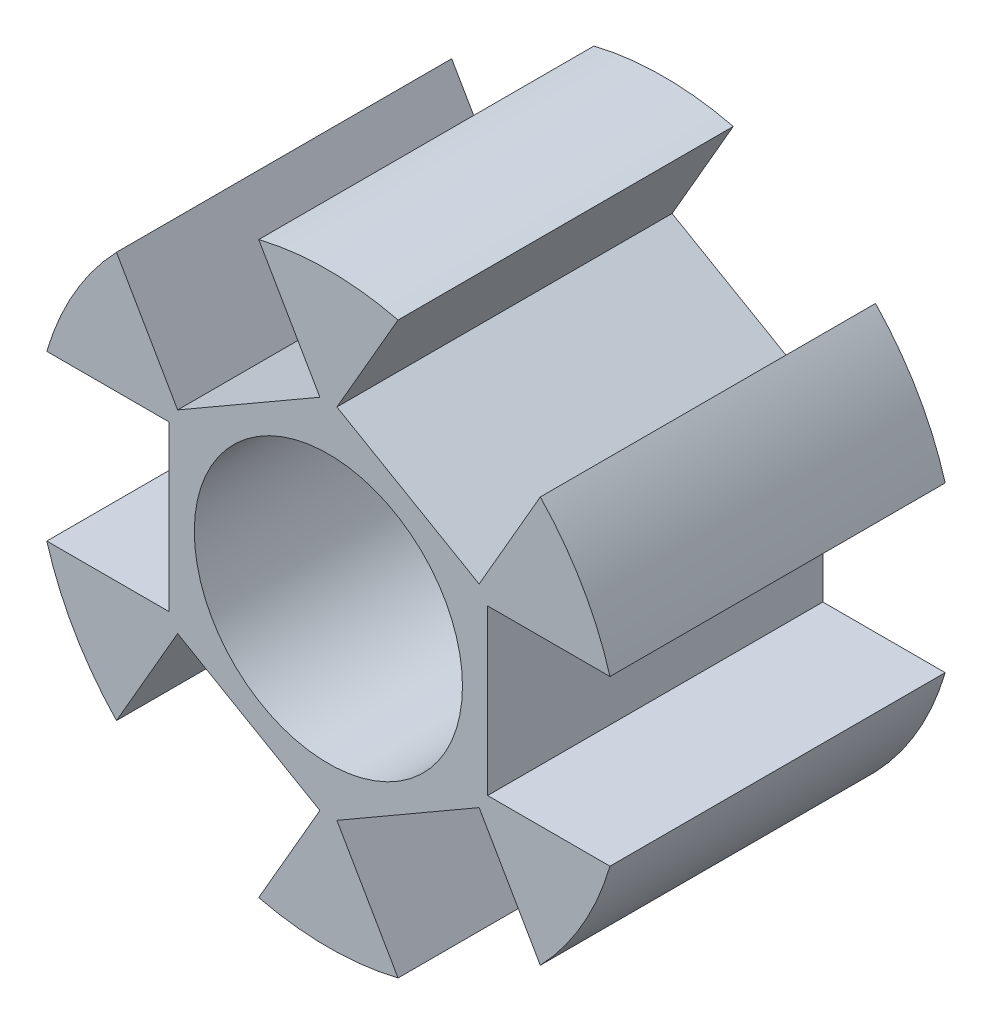
ISO-10303-21;
HEADER;
FILE_DESCRIPTION(('STEP AP214'),'2;1');
FILE_NAME('part.step','',(''),(''),'','','');
FILE_SCHEMA(('AUTOMOTIVE_DESIGN { 1 0 10303 214 1 1 1 1 }'));
ENDSEC;
DATA;
#1=APPLICATION_CONTEXT('core data for automotive mechanical design processes');
#2=APPLICATION_PROTOCOL_DEFINITION('international standard','automotive_design',2000,#1);
#3=PRODUCT_CONTEXT('',#1,'mechanical');
#4=PRODUCT('Part','Part','',(#3));
#5=PRODUCT_RELATED_PRODUCT_CATEGORY('part','',(#4));
#6=PRODUCT_DEFINITION_FORMATION('','',#4);
#7=PRODUCT_DEFINITION_CONTEXT('part definition',#1,'design');
#8=PRODUCT_DEFINITION('design','',#6,#7);
#9=PRODUCT_DEFINITION_SHAPE('','',#8);
#10=(LENGTH_UNIT() NAMED_UNIT(*) SI_UNIT(.MILLI.,.METRE.));
#11=(NAMED_UNIT(*) PLANE_ANGLE_UNIT() SI_UNIT($,.RADIAN.));
#12=(NAMED_UNIT(*) SI_UNIT($,.STERADIAN.) SOLID_ANGLE_UNIT());
#13=UNCERTAINTY_MEASURE_WITH_UNIT(LENGTH_MEASURE(1.E-05),#10,'distance_accuracy_value','');
#14=(GEOMETRIC_REPRESENTATION_CONTEXT(3) GLOBAL_UNCERTAINTY_ASSIGNED_CONTEXT((#13)) GLOBAL_UNIT_ASSIGNED_CONTEXT((#10,
#11,#12)) REPRESENTATION_CONTEXT('',''));
#15=CARTESIAN_POINT('',(0.,0.,0.));
#16=DIRECTION('',(0.,0.,1.));
#17=DIRECTION('',(1.,0.,0.));
#18=AXIS2_PLACEMENT_3D('',#15,#16,#17);
#19=CARTESIAN_POINT('',(0.,0.,5.));
#20=DIRECTION('',(0.,0.,1.));
#21=DIRECTION('',(1.,0.,0.));
#22=AXIS2_PLACEMENT_3D('',#19,#20,#21);
#23=PLANE('',#22);
#24=CARTESIAN_POINT('',(0.,0.,5.));
#25=DIRECTION('',(0.,0.,1.));
#26=DIRECTION('',(1.,0.,0.));
#27=AXIS2_PLACEMENT_3D('',#24,#25,#26);
#28=CIRCLE('',#27,4.);
#29=CARTESIAN_POINT('',(4.,0.,5.));
#30=VERTEX_POINT('',#29);
#31=EDGE_CURVE('E337',#30,#30,#28,.T.);
#32=ORIENTED_EDGE('',*,*,#31,.F.);
#33=EDGE_LOOP('',(#32));
#34=FACE_BOUND('',#33,.T.);
#35=DIRECTION('',(-0.866025403784433,-0.50000000000001,0.));
#36=VECTOR('',#35,1.);
#37=CARTESIAN_POINT('',(-0.253237760728186,5.33862066797608,5.));
#38=LINE('',#37,#36);
#39=CARTESIAN_POINT('',(-0.253237760728186,5.33862066797608,5.));
#40=VERTEX_POINT('',#39);
#41=CARTESIAN_POINT('',(-4.49676223927191,2.88862066797603,5.));
#42=VERTEX_POINT('',#41);
#43=EDGE_CURVE('E281',#40,#42,#38,.T.);
#44=ORIENTED_EDGE('',*,*,#43,.T.);
#45=DIRECTION('',(-0.50000000000001,0.866025403784433,0.));
#46=VECTOR('',#45,1.);
#47=CARTESIAN_POINT('',(-4.49676223927191,2.88862066797603,5.));
#48=LINE('',#47,#46);
#49=CARTESIAN_POINT('',(-6.32176223927195,6.04961339178921,5.));
#50=VERTEX_POINT('',#49);
#51=EDGE_CURVE('E289',#42,#50,#48,.T.);
#52=ORIENTED_EDGE('',*,*,#51,.T.);
#53=CARTESIAN_POINT('',(0.,0.,5.));
#54=DIRECTION('',(0.,0.,1.));
#55=DIRECTION('',(1.,0.,0.));
#56=AXIS2_PLACEMENT_3D('',#53,#54,#55);
#57=CIRCLE('',#56,8.75);
#58=CARTESIAN_POINT('',(-8.4,2.45,5.));
#59=VERTEX_POINT('',#58);
#60=EDGE_CURVE('E349',#50,#59,#57,.T.);
#61=ORIENTED_EDGE('',*,*,#60,.T.);
#62=DIRECTION('',(-1.,0.,0.));
#63=VECTOR('',#62,1.);
#64=CARTESIAN_POINT('',(-4.75,2.45,5.));
#65=LINE('',#64,#63);
#66=CARTESIAN_POINT('',(-4.75,2.45,5.));
#67=VERTEX_POINT('',#66);
#68=EDGE_CURVE('E329',#67,#59,#65,.T.);
#69=ORIENTED_EDGE('',*,*,#68,.F.);
#70=DIRECTION('',(0.,-1.,0.));
#71=VECTOR('',#70,1.);
#72=CARTESIAN_POINT('',(-4.75,2.45,5.));
#73=LINE('',#72,#71);
#74=CARTESIAN_POINT('',(-4.75,-2.45,5.));
#75=VERTEX_POINT('',#74);
#76=EDGE_CURVE('E321',#67,#75,#73,.T.);
#77=ORIENTED_EDGE('',*,*,#76,.T.);
#78=DIRECTION('',(-1.,0.,0.));
#79=VECTOR('',#78,1.);
#80=CARTESIAN_POINT('',(-4.75,-2.45,5.));
#81=LINE('',#80,#79);
#82=CARTESIAN_POINT('',(-8.4,-2.45,5.));
#83=VERTEX_POINT('',#82);
#84=EDGE_CURVE('E323',#75,#83,#81,.T.);
#85=ORIENTED_EDGE('',*,*,#84,.T.);
#86=CARTESIAN_POINT('',(-6.32176223927186,-6.0496133917893,5.));
#87=VERTEX_POINT('',#86);
#88=EDGE_CURVE('E342',#83,#87,#57,.T.);
#89=ORIENTED_EDGE('',*,*,#88,.T.);
#90=DIRECTION('',(-0.499999999999998,-0.86602540378444,0.));
#91=VECTOR('',#90,1.);
#92=CARTESIAN_POINT('',(-4.49676223927187,-2.88862066797609,5.));
#93=LINE('',#92,#91);
#94=CARTESIAN_POINT('',(-4.49676223927187,-2.88862066797609,5.));
#95=VERTEX_POINT('',#94);
#96=EDGE_CURVE('E306',#95,#87,#93,.T.);
#97=ORIENTED_EDGE('',*,*,#96,.F.);
#98=DIRECTION('',(0.86602540378444,-0.499999999999998,0.));
#99=VECTOR('',#98,1.);
#100=CARTESIAN_POINT('',(-4.49676223927187,-2.88862066797609,5.));
#101=LINE('',#100,#99);
#102=CARTESIAN_POINT('',(-0.253237760728112,-5.33862066797608,5.));
#103=VERTEX_POINT('',#102);
#104=EDGE_CURVE('E297',#95,#103,#101,.T.);
#105=ORIENTED_EDGE('',*,*,#104,.T.);
#106=DIRECTION('',(-0.499999999999998,-0.86602540378444,0.));
#107=VECTOR('',#106,1.);
#108=CARTESIAN_POINT('',(-0.253237760728112,-5.33862066797608,5.));
#109=LINE('',#108,#107);
#110=CARTESIAN_POINT('',(-2.07823776072811,-8.49961339178929,5.));
#111=VERTEX_POINT('',#110);
#112=EDGE_CURVE('E303',#103,#111,#109,.T.);
#113=ORIENTED_EDGE('',*,*,#112,.T.);
#114=CARTESIAN_POINT('',(2.07823776072817,-8.49961339178928,5.));
#115=VERTEX_POINT('',#114);
#116=EDGE_CURVE('E348',#111,#115,#57,.T.);
#117=ORIENTED_EDGE('',*,*,#116,.T.);
#118=DIRECTION('',(0.500000000000004,-0.866025403784436,0.));
#119=VECTOR('',#118,1.);
#120=CARTESIAN_POINT('',(0.253237760728149,-5.33862066797608,5.));
#121=LINE('',#120,#119);
#122=CARTESIAN_POINT('',(0.253237760728149,-5.33862066797608,5.));
#123=VERTEX_POINT('',#122);
#124=EDGE_CURVE('E231',#123,#115,#121,.T.);
#125=ORIENTED_EDGE('',*,*,#124,.F.);
#126=DIRECTION('',(0.866025403784436,0.500000000000004,0.));
#127=VECTOR('',#126,1.);
#128=CARTESIAN_POINT('',(0.253237760728149,-5.33862066797608,5.));
#129=LINE('',#128,#127);
#130=CARTESIAN_POINT('',(4.49676223927189,-2.88862066797606,5.));
#131=VERTEX_POINT('',#130);
#132=EDGE_CURVE('E516',#123,#131,#129,.T.);
#133=ORIENTED_EDGE('',*,*,#132,.T.);
#134=DIRECTION('',(0.500000000000004,-0.866025403784436,0.));
#135=VECTOR('',#134,1.);
#136=CARTESIAN_POINT('',(4.49676223927189,-2.88862066797606,5.));
#137=LINE('',#136,#135);
#138=CARTESIAN_POINT('',(6.3217622392719,-6.04961339178926,5.));
#139=VERTEX_POINT('',#138);
#140=EDGE_CURVE('E217',#131,#139,#137,.T.);
#141=ORIENTED_EDGE('',*,*,#140,.T.);
#142=CARTESIAN_POINT('',(8.4,-2.45,5.));
#143=VERTEX_POINT('',#142);
#144=EDGE_CURVE('E430',#139,#143,#57,.T.);
#145=ORIENTED_EDGE('',*,*,#144,.T.);
#146=DIRECTION('',(1.,0.,0.));
#147=VECTOR('',#146,1.);
#148=CARTESIAN_POINT('',(4.75,-2.45,5.));
#149=LINE('',#148,#147);
#150=CARTESIAN_POINT('',(4.75,-2.45,5.));
#151=VERTEX_POINT('',#150);
#152=EDGE_CURVE('E255',#151,#143,#149,.T.);
#153=ORIENTED_EDGE('',*,*,#152,.F.);
#154=DIRECTION('',(0.,1.,0.));
#155=VECTOR('',#154,1.);
#156=CARTESIAN_POINT('',(4.75,-2.45,5.));
#157=LINE('',#156,#155);
#158=CARTESIAN_POINT('',(4.75,2.45,5.));
#159=VERTEX_POINT('',#158);
#160=EDGE_CURVE('E246',#151,#159,#157,.T.);
#161=ORIENTED_EDGE('',*,*,#160,.T.);
#162=DIRECTION('',(1.,0.,0.));
#163=VECTOR('',#162,1.);
#164=CARTESIAN_POINT('',(4.75,2.45,5.));
#165=LINE('',#164,#163);
#166=CARTESIAN_POINT('',(8.4,2.45,5.));
#167=VERTEX_POINT('',#166);
#168=EDGE_CURVE('E248',#159,#167,#165,.T.);
#169=ORIENTED_EDGE('',*,*,#168,.T.);
#170=CARTESIAN_POINT('',(6.32176223927182,6.04961339178935,5.));
#171=VERTEX_POINT('',#170);
#172=EDGE_CURVE('E429',#167,#171,#57,.T.);
#173=ORIENTED_EDGE('',*,*,#172,.T.);
#174=DIRECTION('',(0.499999999999992,0.866025403784443,0.));
#175=VECTOR('',#174,1.);
#176=CARTESIAN_POINT('',(4.49676223927185,2.88862066797612,5.));
#177=LINE('',#176,#175);
#178=CARTESIAN_POINT('',(4.49676223927185,2.88862066797612,5.));
#179=VERTEX_POINT('',#178);
#180=EDGE_CURVE('E63',#179,#171,#177,.T.);
#181=ORIENTED_EDGE('',*,*,#180,.F.);
#182=DIRECTION('',(-0.866025403784443,0.499999999999992,0.));
#183=VECTOR('',#182,1.);
#184=CARTESIAN_POINT('',(4.49676223927185,2.88862066797612,5.));
#185=LINE('',#184,#183);
#186=CARTESIAN_POINT('',(0.253237760728075,5.33862066797609,5.));
#187=VERTEX_POINT('',#186);
#188=EDGE_CURVE('E266',#179,#187,#185,.T.);
#189=ORIENTED_EDGE('',*,*,#188,.T.);
#190=DIRECTION('',(0.499999999999992,0.866025403784443,0.));
#191=VECTOR('',#190,1.);
#192=CARTESIAN_POINT('',(0.253237760728075,5.33862066797609,5.));
#193=LINE('',#192,#191);
#194=CARTESIAN_POINT('',(2.07823776072805,8.49961339178931,5.));
#195=VERTEX_POINT('',#194);
#196=EDGE_CURVE('E268',#187,#195,#193,.T.);
#197=ORIENTED_EDGE('',*,*,#196,.T.);
#198=CARTESIAN_POINT('',(-2.07823776072823,8.49961339178926,5.));
#199=VERTEX_POINT('',#198);
#200=EDGE_CURVE('E433',#195,#199,#57,.T.);
#201=ORIENTED_EDGE('',*,*,#200,.T.);
#202=DIRECTION('',(-0.50000000000001,0.866025403784433,0.));
#203=VECTOR('',#202,1.);
#204=CARTESIAN_POINT('',(-0.253237760728186,5.33862066797608,5.));
#205=LINE('',#204,#203);
#206=EDGE_CURVE('E57',#40,#199,#205,.T.);
#207=ORIENTED_EDGE('',*,*,#206,.F.);
#208=EDGE_LOOP('',(#44,#52,#61,#69,#77,#85,#89,#97,#105,#113,#117,#125,#133,#141,#145,#153,#161,
#169,#173,#181,#189,#197,#201,#207));
#209=FACE_BOUND('',#208,.T.);
#210=ADVANCED_FACE('F41',(#34,#209),#23,.T.);
#211=CARTESIAN_POINT('',(0.,0.,-5.));
#212=DIRECTION('',(0.,0.,1.));
#213=DIRECTION('',(1.,0.,0.));
#214=AXIS2_PLACEMENT_3D('',#211,#212,#213);
#215=PLANE('',#214);
#216=CARTESIAN_POINT('',(0.,0.,-5.));
#217=DIRECTION('',(0.,0.,1.));
#218=DIRECTION('',(1.,0.,0.));
#219=AXIS2_PLACEMENT_3D('',#216,#217,#218);
#220=CIRCLE('',#219,4.);
#221=CARTESIAN_POINT('',(4.,0.,-5.));
#222=VERTEX_POINT('',#221);
#223=EDGE_CURVE('E335',#222,#222,#220,.T.);
#224=ORIENTED_EDGE('',*,*,#223,.T.);
#225=EDGE_LOOP('',(#224));
#226=FACE_BOUND('',#225,.T.);
#227=DIRECTION('',(-0.50000000000001,0.866025403784433,0.));
#228=VECTOR('',#227,1.);
#229=CARTESIAN_POINT('',(-4.49676223927191,2.88862066797603,-5.));
#230=LINE('',#229,#228);
#231=CARTESIAN_POINT('',(-4.49676223927191,2.88862066797603,-5.));
#232=VERTEX_POINT('',#231);
#233=CARTESIAN_POINT('',(-6.32176223927195,6.04961339178921,-5.));
#234=VERTEX_POINT('',#233);
#235=EDGE_CURVE('E263',#232,#234,#230,.T.);
#236=ORIENTED_EDGE('',*,*,#235,.F.);
#237=DIRECTION('',(0.866025403784433,0.50000000000001,0.));
#238=VECTOR('',#237,1.);
#239=CARTESIAN_POINT('',(-0.253237760728186,5.33862066797608,-5.));
#240=LINE('',#239,#238);
#241=CARTESIAN_POINT('',(-0.253237760728186,5.33862066797608,-5.));
#242=VERTEX_POINT('',#241);
#243=EDGE_CURVE('E280',#232,#242,#240,.T.);
#244=ORIENTED_EDGE('',*,*,#243,.T.);
#245=DIRECTION('',(-0.50000000000001,0.866025403784433,0.));
#246=VECTOR('',#245,1.);
#247=CARTESIAN_POINT('',(-0.253237760728186,5.33862066797608,-5.));
#248=LINE('',#247,#246);
#249=CARTESIAN_POINT('',(-2.07823776072823,8.49961339178926,-5.));
#250=VERTEX_POINT('',#249);
#251=EDGE_CURVE('E292',#242,#250,#248,.T.);
#252=ORIENTED_EDGE('',*,*,#251,.T.);
#253=CARTESIAN_POINT('',(0.,0.,-5.));
#254=DIRECTION('',(0.,0.,1.));
#255=DIRECTION('',(1.,0.,0.));
#256=AXIS2_PLACEMENT_3D('',#253,#254,#255);
#257=CIRCLE('',#256,8.75);
#258=CARTESIAN_POINT('',(2.07823776072805,8.49961339178931,-5.));
#259=VERTEX_POINT('',#258);
#260=EDGE_CURVE('E378',#259,#250,#257,.T.);
#261=ORIENTED_EDGE('',*,*,#260,.F.);
#262=DIRECTION('',(0.499999999999992,0.866025403784443,0.));
#263=VECTOR('',#262,1.);
#264=CARTESIAN_POINT('',(0.253237760728075,5.33862066797609,-5.));
#265=LINE('',#264,#263);
#266=CARTESIAN_POINT('',(0.253237760728075,5.33862066797609,-5.));
#267=VERTEX_POINT('',#266);
#268=EDGE_CURVE('E241',#267,#259,#265,.T.);
#269=ORIENTED_EDGE('',*,*,#268,.F.);
#270=DIRECTION('',(0.866025403784443,-0.499999999999992,0.));
#271=VECTOR('',#270,1.);
#272=CARTESIAN_POINT('',(4.49676223927185,2.88862066797612,-5.));
#273=LINE('',#272,#271);
#274=CARTESIAN_POINT('',(4.49676223927185,2.88862066797612,-5.));
#275=VERTEX_POINT('',#274);
#276=EDGE_CURVE('E260',#267,#275,#273,.T.);
#277=ORIENTED_EDGE('',*,*,#276,.T.);
#278=DIRECTION('',(0.499999999999992,0.866025403784443,0.));
#279=VECTOR('',#278,1.);
#280=CARTESIAN_POINT('',(4.49676223927185,2.88862066797612,-5.));
#281=LINE('',#280,#279);
#282=CARTESIAN_POINT('',(6.32176223927182,6.04961339178935,-5.));
#283=VERTEX_POINT('',#282);
#284=EDGE_CURVE('E271',#275,#283,#281,.T.);
#285=ORIENTED_EDGE('',*,*,#284,.T.);
#286=CARTESIAN_POINT('',(8.4,2.45,-5.));
#287=VERTEX_POINT('',#286);
#288=EDGE_CURVE('E385',#287,#283,#257,.T.);
#289=ORIENTED_EDGE('',*,*,#288,.F.);
#290=DIRECTION('',(1.,0.,0.));
#291=VECTOR('',#290,1.);
#292=CARTESIAN_POINT('',(4.75,2.45,-5.));
#293=LINE('',#292,#291);
#294=CARTESIAN_POINT('',(4.75,2.45,-5.));
#295=VERTEX_POINT('',#294);
#296=EDGE_CURVE('E220',#295,#287,#293,.T.);
#297=ORIENTED_EDGE('',*,*,#296,.F.);
#298=DIRECTION('',(0.,-1.,0.));
#299=VECTOR('',#298,1.);
#300=CARTESIAN_POINT('',(4.75,-2.45,-5.));
#301=LINE('',#300,#299);
#302=CARTESIAN_POINT('',(4.75,-2.45,-5.));
#303=VERTEX_POINT('',#302);
#304=EDGE_CURVE('E239',#295,#303,#301,.T.);
#305=ORIENTED_EDGE('',*,*,#304,.T.);
#306=DIRECTION('',(1.,0.,0.));
#307=VECTOR('',#306,1.);
#308=CARTESIAN_POINT('',(4.75,-2.45,-5.));
#309=LINE('',#308,#307);
#310=CARTESIAN_POINT('',(8.4,-2.45,-5.));
#311=VERTEX_POINT('',#310);
#312=EDGE_CURVE('E251',#303,#311,#309,.T.);
#313=ORIENTED_EDGE('',*,*,#312,.T.);
#314=CARTESIAN_POINT('',(6.3217622392719,-6.04961339178926,-5.));
#315=VERTEX_POINT('',#314);
#316=EDGE_CURVE('E228',#315,#311,#257,.T.);
#317=ORIENTED_EDGE('',*,*,#316,.F.);
#318=DIRECTION('',(0.500000000000004,-0.866025403784436,0.));
#319=VECTOR('',#318,1.);
#320=CARTESIAN_POINT('',(4.49676223927189,-2.88862066797606,-5.));
#321=LINE('',#320,#319);
#322=CARTESIAN_POINT('',(4.49676223927189,-2.88862066797606,-5.));
#323=VERTEX_POINT('',#322);
#324=EDGE_CURVE('E215',#323,#315,#321,.T.);
#325=ORIENTED_EDGE('',*,*,#324,.F.);
#326=DIRECTION('',(-0.866025403784436,-0.500000000000004,0.));
#327=VECTOR('',#326,1.);
#328=CARTESIAN_POINT('',(0.253237760728149,-5.33862066797608,-5.));
#329=LINE('',#328,#327);
#330=CARTESIAN_POINT('',(0.253237760728149,-5.33862066797608,-5.));
#331=VERTEX_POINT('',#330);
#332=EDGE_CURVE('E202',#323,#331,#329,.T.);
#333=ORIENTED_EDGE('',*,*,#332,.T.);
#334=DIRECTION('',(0.500000000000004,-0.866025403784436,0.));
#335=VECTOR('',#334,1.);
#336=CARTESIAN_POINT('',(0.253237760728149,-5.33862066797608,-5.));
#337=LINE('',#336,#335);
#338=CARTESIAN_POINT('',(2.07823776072816,-8.49961339178928,-5.));
#339=VERTEX_POINT('',#338);
#340=EDGE_CURVE('E226',#331,#339,#337,.T.);
#341=ORIENTED_EDGE('',*,*,#340,.T.);
#342=CARTESIAN_POINT('',(-2.07823776072811,-8.49961339178929,-5.));
#343=VERTEX_POINT('',#342);
#344=EDGE_CURVE('E351',#343,#339,#257,.T.);
#345=ORIENTED_EDGE('',*,*,#344,.F.);
#346=DIRECTION('',(-0.499999999999998,-0.86602540378444,0.));
#347=VECTOR('',#346,1.);
#348=CARTESIAN_POINT('',(-0.253237760728112,-5.33862066797608,-5.));
#349=LINE('',#348,#347);
#350=CARTESIAN_POINT('',(-0.253237760728112,-5.33862066797608,-5.));
#351=VERTEX_POINT('',#350);
#352=EDGE_CURVE('E311',#351,#343,#349,.T.);
#353=ORIENTED_EDGE('',*,*,#352,.F.);
#354=DIRECTION('',(-0.86602540378444,0.499999999999998,0.));
#355=VECTOR('',#354,1.);
#356=CARTESIAN_POINT('',(-4.49676223927187,-2.88862066797609,-5.));
#357=LINE('',#356,#355);
#358=CARTESIAN_POINT('',(-4.49676223927187,-2.88862066797609,-5.));
#359=VERTEX_POINT('',#358);
#360=EDGE_CURVE('E233',#351,#359,#357,.T.);
#361=ORIENTED_EDGE('',*,*,#360,.T.);
#362=DIRECTION('',(-0.499999999999998,-0.86602540378444,0.));
#363=VECTOR('',#362,1.);
#364=CARTESIAN_POINT('',(-4.49676223927187,-2.88862066797609,-5.));
#365=LINE('',#364,#363);
#366=CARTESIAN_POINT('',(-6.32176223927186,-6.0496133917893,-5.));
#367=VERTEX_POINT('',#366);
#368=EDGE_CURVE('E308',#359,#367,#365,.T.);
#369=ORIENTED_EDGE('',*,*,#368,.T.);
#370=CARTESIAN_POINT('',(-8.4,-2.45,-5.));
#371=VERTEX_POINT('',#370);
#372=EDGE_CURVE('E347',#371,#367,#257,.T.);
#373=ORIENTED_EDGE('',*,*,#372,.F.);
#374=DIRECTION('',(-1.,0.,0.));
#375=VECTOR('',#374,1.);
#376=CARTESIAN_POINT('',(-4.75,-2.45,-5.));
#377=LINE('',#376,#375);
#378=CARTESIAN_POINT('',(-4.75,-2.45,-5.));
#379=VERTEX_POINT('',#378);
#380=EDGE_CURVE('E334',#379,#371,#377,.T.);
#381=ORIENTED_EDGE('',*,*,#380,.F.);
#382=DIRECTION('',(0.,1.,0.));
#383=VECTOR('',#382,1.);
#384=CARTESIAN_POINT('',(-4.75,2.45,-5.));
#385=LINE('',#384,#383);
#386=CARTESIAN_POINT('',(-4.75,2.45,-5.));
#387=VERTEX_POINT('',#386);
#388=EDGE_CURVE('E317',#379,#387,#385,.T.);
#389=ORIENTED_EDGE('',*,*,#388,.T.);
#390=DIRECTION('',(-1.,0.,0.));
#391=VECTOR('',#390,1.);
#392=CARTESIAN_POINT('',(-4.75,2.45,-5.));
#393=LINE('',#392,#391);
#394=CARTESIAN_POINT('',(-8.4,2.45,-5.));
#395=VERTEX_POINT('',#394);
#396=EDGE_CURVE('E326',#387,#395,#393,.T.);
#397=ORIENTED_EDGE('',*,*,#396,.T.);
#398=EDGE_CURVE('E339',#234,#395,#257,.T.);
#399=ORIENTED_EDGE('',*,*,#398,.F.);
#400=EDGE_LOOP('',(#236,#244,#252,#261,#269,#277,#285,#289,#297,#305,#313,#317,#325,#333,#341,
#345,#353,#361,#369,#373,#381,#389,#397,#399));
#401=FACE_BOUND('',#400,.T.);
#402=ADVANCED_FACE('F224',(#226,#401),#215,.F.);
#403=CARTESIAN_POINT('',(0.,0.,5.));
#404=DIRECTION('',(0.,0.,-1.));
#405=DIRECTION('',(-1.,0.,0.));
#406=AXIS2_PLACEMENT_3D('',#403,#404,#405);
#407=CYLINDRICAL_SURFACE('',#406,8.75);
#408=DIRECTION('',(0.,0.,-1.));
#409=VECTOR('',#408,1.);
#410=CARTESIAN_POINT('',(-6.32176223927195,6.04961339178921,5.));
#411=LINE('',#410,#409);
#412=EDGE_CURVE('E11',#234,#50,#411,.F.);
#413=ORIENTED_EDGE('',*,*,#412,.F.);
#414=ORIENTED_EDGE('',*,*,#398,.T.);
#415=DIRECTION('',(0.,0.,-1.));
#416=VECTOR('',#415,1.);
#417=CARTESIAN_POINT('',(-8.4,2.45,5.));
#418=LINE('',#417,#416);
#419=EDGE_CURVE('E345',#59,#395,#418,.T.);
#420=ORIENTED_EDGE('',*,*,#419,.F.);
#421=ORIENTED_EDGE('',*,*,#60,.F.);
#422=EDGE_LOOP('',(#413,#414,#420,#421));
#423=FACE_BOUND('',#422,.T.);
#424=ADVANCED_FACE('F43',(#423),#407,.T.);
#425=DIRECTION('',(0.,0.,-1.));
#426=VECTOR('',#425,1.);
#427=CARTESIAN_POINT('',(-2.07823776072823,8.49961339178926,5.));
#428=LINE('',#427,#426);
#429=EDGE_CURVE('E47',#199,#250,#428,.T.);
#430=ORIENTED_EDGE('',*,*,#429,.F.);
#431=ORIENTED_EDGE('',*,*,#200,.F.);
#432=DIRECTION('',(0.,0.,-1.));
#433=VECTOR('',#432,1.);
#434=CARTESIAN_POINT('',(2.07823776072805,8.49961339178931,5.));
#435=LINE('',#434,#433);
#436=EDGE_CURVE('E369',#259,#195,#435,.F.);
#437=ORIENTED_EDGE('',*,*,#436,.F.);
#438=ORIENTED_EDGE('',*,*,#260,.T.);
#439=EDGE_LOOP('',(#430,#431,#437,#438));
#440=FACE_BOUND('',#439,.T.);
#441=ADVANCED_FACE('F382',(#440),#407,.T.);
#442=DIRECTION('',(0.,0.,-1.));
#443=VECTOR('',#442,1.);
#444=CARTESIAN_POINT('',(6.32176223927182,6.04961339178935,5.));
#445=LINE('',#444,#443);
#446=EDGE_CURVE('E368',#171,#283,#445,.T.);
#447=ORIENTED_EDGE('',*,*,#446,.F.);
#448=ORIENTED_EDGE('',*,*,#172,.F.);
#449=DIRECTION('',(0.,0.,-1.));
#450=VECTOR('',#449,1.);
#451=CARTESIAN_POINT('',(8.4,2.45,5.));
#452=LINE('',#451,#450);
#453=EDGE_CURVE('E366',#287,#167,#452,.F.);
#454=ORIENTED_EDGE('',*,*,#453,.F.);
#455=ORIENTED_EDGE('',*,*,#288,.T.);
#456=EDGE_LOOP('',(#447,#448,#454,#455));
#457=FACE_BOUND('',#456,.T.);
#458=ADVANCED_FACE('F504',(#457),#407,.T.);
#459=DIRECTION('',(0.,0.,-1.));
#460=VECTOR('',#459,1.);
#461=CARTESIAN_POINT('',(8.4,-2.45,5.));
#462=LINE('',#461,#460);
#463=EDGE_CURVE('E364',#143,#311,#462,.T.);
#464=ORIENTED_EDGE('',*,*,#463,.F.);
#465=ORIENTED_EDGE('',*,*,#144,.F.);
#466=DIRECTION('',(0.,0.,-1.));
#467=VECTOR('',#466,1.);
#468=CARTESIAN_POINT('',(6.3217622392719,-6.04961339178926,5.));
#469=LINE('',#468,#467);
#470=EDGE_CURVE('E365',#315,#139,#469,.F.);
#471=ORIENTED_EDGE('',*,*,#470,.F.);
#472=ORIENTED_EDGE('',*,*,#316,.T.);
#473=EDGE_LOOP('',(#464,#465,#471,#472));
#474=FACE_BOUND('',#473,.T.);
#475=ADVANCED_FACE('F514',(#474),#407,.T.);
#476=DIRECTION('',(0.,0.,-1.));
#477=VECTOR('',#476,1.);
#478=CARTESIAN_POINT('',(2.07823776072816,-8.49961339178928,5.));
#479=LINE('',#478,#477);
#480=EDGE_CURVE('E359',#115,#339,#479,.T.);
#481=ORIENTED_EDGE('',*,*,#480,.F.);
#482=ORIENTED_EDGE('',*,*,#116,.F.);
#483=DIRECTION('',(0.,0.,-1.));
#484=VECTOR('',#483,1.);
#485=CARTESIAN_POINT('',(-2.07823776072811,-8.49961339178929,5.));
#486=LINE('',#485,#484);
#487=EDGE_CURVE('E356',#343,#111,#486,.F.);
#488=ORIENTED_EDGE('',*,*,#487,.F.);
#489=ORIENTED_EDGE('',*,*,#344,.T.);
#490=EDGE_LOOP('',(#481,#482,#488,#489));
#491=FACE_BOUND('',#490,.T.);
#492=ADVANCED_FACE('F424',(#491),#407,.T.);
#493=DIRECTION('',(0.,0.,-1.));
#494=VECTOR('',#493,1.);
#495=CARTESIAN_POINT('',(-6.32176223927186,-6.0496133917893,5.));
#496=LINE('',#495,#494);
#497=EDGE_CURVE('E358',#87,#367,#496,.T.);
#498=ORIENTED_EDGE('',*,*,#497,.F.);
#499=ORIENTED_EDGE('',*,*,#88,.F.);
#500=DIRECTION('',(0.,0.,-1.));
#501=VECTOR('',#500,1.);
#502=CARTESIAN_POINT('',(-8.4,-2.45,5.));
#503=LINE('',#502,#501);
#504=EDGE_CURVE('E353',#371,#83,#503,.F.);
#505=ORIENTED_EDGE('',*,*,#504,.F.);
#506=ORIENTED_EDGE('',*,*,#372,.T.);
#507=EDGE_LOOP('',(#498,#499,#505,#506));
#508=FACE_BOUND('',#507,.T.);
#509=ADVANCED_FACE('F407',(#508),#407,.T.);
#510=CARTESIAN_POINT('',(0.,0.,5.));
#511=DIRECTION('',(0.,0.,-1.));
#512=DIRECTION('',(-1.,0.,0.));
#513=AXIS2_PLACEMENT_3D('',#510,#511,#512);
#514=CYLINDRICAL_SURFACE('',#513,4.);
#515=ORIENTED_EDGE('',*,*,#31,.T.);
#516=EDGE_LOOP('',(#515));
#517=FACE_BOUND('',#516,.T.);
#518=ORIENTED_EDGE('',*,*,#223,.F.);
#519=EDGE_LOOP('',(#518));
#520=FACE_BOUND('',#519,.T.);
#521=ADVANCED_FACE('F457',(#517,#520),#514,.F.);
#522=CARTESIAN_POINT('',(-4.75,-2.45,5.));
#523=DIRECTION('',(0.,1.,0.));
#524=DIRECTION('',(0.,0.,1.));
#525=AXIS2_PLACEMENT_3D('',#522,#523,#524);
#526=PLANE('',#525);
#527=ORIENTED_EDGE('',*,*,#504,.T.);
#528=ORIENTED_EDGE('',*,*,#84,.F.);
#529=DIRECTION('',(0.,0.,-1.));
#530=VECTOR('',#529,1.);
#531=CARTESIAN_POINT('',(-4.75,-2.45,5.));
#532=LINE('',#531,#530);
#533=EDGE_CURVE('E312',#75,#379,#532,.T.);
#534=ORIENTED_EDGE('',*,*,#533,.T.);
#535=ORIENTED_EDGE('',*,*,#380,.T.);
#536=EDGE_LOOP('',(#527,#528,#534,#535));
#537=FACE_BOUND('',#536,.T.);
#538=ADVANCED_FACE('F400',(#537),#526,.T.);
#539=CARTESIAN_POINT('',(-4.75,2.45,5.));
#540=DIRECTION('',(0.,-1.,0.));
#541=DIRECTION('',(0.,0.,-1.));
#542=AXIS2_PLACEMENT_3D('',#539,#540,#541);
#543=PLANE('',#542);
#544=ORIENTED_EDGE('',*,*,#419,.T.);
#545=ORIENTED_EDGE('',*,*,#396,.F.);
#546=DIRECTION('',(0.,0.,1.));
#547=VECTOR('',#546,1.);
#548=CARTESIAN_POINT('',(-4.75,2.45,5.));
#549=LINE('',#548,#547);
#550=EDGE_CURVE('E316',#387,#67,#549,.T.);
#551=ORIENTED_EDGE('',*,*,#550,.T.);
#552=ORIENTED_EDGE('',*,*,#68,.T.);
#553=EDGE_LOOP('',(#544,#545,#551,#552));
#554=FACE_BOUND('',#553,.T.);
#555=ADVANCED_FACE('F390',(#554),#543,.T.);
#556=CARTESIAN_POINT('',(-4.75,0.,0.));
#557=DIRECTION('',(-1.,0.,0.));
#558=DIRECTION('',(0.,0.,1.));
#559=AXIS2_PLACEMENT_3D('',#556,#557,#558);
#560=PLANE('',#559);
#561=ORIENTED_EDGE('',*,*,#533,.F.);
#562=ORIENTED_EDGE('',*,*,#76,.F.);
#563=ORIENTED_EDGE('',*,*,#550,.F.);
#564=ORIENTED_EDGE('',*,*,#388,.F.);
#565=EDGE_LOOP('',(#561,#562,#563,#564));
#566=FACE_BOUND('',#565,.T.);
#567=ADVANCED_FACE('F397',(#566),#560,.T.);
#568=CARTESIAN_POINT('',(-0.253237760728112,-5.33862066797608,5.));
#569=DIRECTION('',(-0.86602540378444,0.499999999999998,0.));
#570=DIRECTION('',(-0.499999999999998,-0.86602540378444,0.));
#571=AXIS2_PLACEMENT_3D('',#568,#569,#570);
#572=PLANE('',#571);
#573=ORIENTED_EDGE('',*,*,#487,.T.);
#574=ORIENTED_EDGE('',*,*,#112,.F.);
#575=DIRECTION('',(0.,0.,-1.));
#576=VECTOR('',#575,1.);
#577=CARTESIAN_POINT('',(-0.253237760728112,-5.33862066797608,5.));
#578=LINE('',#577,#576);
#579=EDGE_CURVE('E227',#103,#351,#578,.T.);
#580=ORIENTED_EDGE('',*,*,#579,.T.);
#581=ORIENTED_EDGE('',*,*,#352,.T.);
#582=EDGE_LOOP('',(#573,#574,#580,#581));
#583=FACE_BOUND('',#582,.T.);
#584=ADVANCED_FACE('F419',(#583),#572,.T.);
#585=CARTESIAN_POINT('',(-4.49676223927187,-2.88862066797609,5.));
#586=DIRECTION('',(0.86602540378444,-0.499999999999998,0.));
#587=DIRECTION('',(0.499999999999998,0.86602540378444,0.));
#588=AXIS2_PLACEMENT_3D('',#585,#586,#587);
#589=PLANE('',#588);
#590=ORIENTED_EDGE('',*,*,#497,.T.);
#591=ORIENTED_EDGE('',*,*,#368,.F.);
#592=DIRECTION('',(0.,0.,1.));
#593=VECTOR('',#592,1.);
#594=CARTESIAN_POINT('',(-4.49676223927187,-2.88862066797609,5.));
#595=LINE('',#594,#593);
#596=EDGE_CURVE('E296',#359,#95,#595,.T.);
#597=ORIENTED_EDGE('',*,*,#596,.T.);
#598=ORIENTED_EDGE('',*,*,#96,.T.);
#599=EDGE_LOOP('',(#590,#591,#597,#598));
#600=FACE_BOUND('',#599,.T.);
#601=ADVANCED_FACE('F408',(#600),#589,.T.);
#602=CARTESIAN_POINT('',(-2.37499999999999,-4.11362066797609,0.));
#603=DIRECTION('',(-0.499999999999998,-0.86602540378444,0.));
#604=DIRECTION('',(0.,0.,1.));
#605=AXIS2_PLACEMENT_3D('',#602,#603,#604);
#606=PLANE('',#605);
#607=ORIENTED_EDGE('',*,*,#579,.F.);
#608=ORIENTED_EDGE('',*,*,#104,.F.);
#609=ORIENTED_EDGE('',*,*,#596,.F.);
#610=ORIENTED_EDGE('',*,*,#360,.F.);
#611=EDGE_LOOP('',(#607,#608,#609,#610));
#612=FACE_BOUND('',#611,.T.);
#613=ADVANCED_FACE('F411',(#612),#606,.T.);
#614=CARTESIAN_POINT('',(4.49676223927189,-2.88862066797606,5.));
#615=DIRECTION('',(-0.866025403784436,-0.500000000000004,0.));
#616=DIRECTION('',(0.500000000000004,-0.866025403784436,0.));
#617=AXIS2_PLACEMENT_3D('',#614,#615,#616);
#618=PLANE('',#617);
#619=ORIENTED_EDGE('',*,*,#470,.T.);
#620=ORIENTED_EDGE('',*,*,#140,.F.);
#621=DIRECTION('',(0.,0.,-1.));
#622=VECTOR('',#621,1.);
#623=CARTESIAN_POINT('',(4.49676223927189,-2.88862066797606,5.));
#624=LINE('',#623,#622);
#625=EDGE_CURVE('E207',#131,#323,#624,.T.);
#626=ORIENTED_EDGE('',*,*,#625,.T.);
#627=ORIENTED_EDGE('',*,*,#324,.T.);
#628=EDGE_LOOP('',(#619,#620,#626,#627));
#629=FACE_BOUND('',#628,.T.);
#630=ADVANCED_FACE('F213',(#629),#618,.T.);
#631=CARTESIAN_POINT('',(0.253237760728149,-5.33862066797608,5.));
#632=DIRECTION('',(0.866025403784436,0.500000000000004,0.));
#633=DIRECTION('',(-0.500000000000004,0.866025403784436,0.));
#634=AXIS2_PLACEMENT_3D('',#631,#632,#633);
#635=PLANE('',#634);
#636=ORIENTED_EDGE('',*,*,#480,.T.);
#637=ORIENTED_EDGE('',*,*,#340,.F.);
#638=DIRECTION('',(0.,0.,1.));
#639=VECTOR('',#638,1.);
#640=CARTESIAN_POINT('',(0.253237760728149,-5.33862066797608,5.));
#641=LINE('',#640,#639);
#642=EDGE_CURVE('E206',#331,#123,#641,.T.);
#643=ORIENTED_EDGE('',*,*,#642,.T.);
#644=ORIENTED_EDGE('',*,*,#124,.T.);
#645=EDGE_LOOP('',(#636,#637,#643,#644));
#646=FACE_BOUND('',#645,.T.);
#647=ADVANCED_FACE('F513',(#646),#635,.T.);
#648=CARTESIAN_POINT('',(2.37500000000002,-4.11362066797607,0.));
#649=DIRECTION('',(0.500000000000004,-0.866025403784436,0.));
#650=DIRECTION('',(0.,0.,1.));
#651=AXIS2_PLACEMENT_3D('',#648,#649,#650);
#652=PLANE('',#651);
#653=ORIENTED_EDGE('',*,*,#625,.F.);
#654=ORIENTED_EDGE('',*,*,#132,.F.);
#655=ORIENTED_EDGE('',*,*,#642,.F.);
#656=ORIENTED_EDGE('',*,*,#332,.F.);
#657=EDGE_LOOP('',(#653,#654,#655,#656));
#658=FACE_BOUND('',#657,.T.);
#659=ADVANCED_FACE('F203',(#658),#652,.T.);
#660=CARTESIAN_POINT('',(4.75,2.45,5.));
#661=DIRECTION('',(0.,-1.,0.));
#662=DIRECTION('',(0.,0.,-1.));
#663=AXIS2_PLACEMENT_3D('',#660,#661,#662);
#664=PLANE('',#663);
#665=ORIENTED_EDGE('',*,*,#453,.T.);
#666=ORIENTED_EDGE('',*,*,#168,.F.);
#667=DIRECTION('',(0.,0.,-1.));
#668=VECTOR('',#667,1.);
#669=CARTESIAN_POINT('',(4.75,2.45,5.));
#670=LINE('',#669,#668);
#671=EDGE_CURVE('E240',#159,#295,#670,.T.);
#672=ORIENTED_EDGE('',*,*,#671,.T.);
#673=ORIENTED_EDGE('',*,*,#296,.T.);
#674=EDGE_LOOP('',(#665,#666,#672,#673));
#675=FACE_BOUND('',#674,.T.);
#676=ADVANCED_FACE('F486',(#675),#664,.T.);
#677=CARTESIAN_POINT('',(4.75,-2.45,5.));
#678=DIRECTION('',(0.,1.,0.));
#679=DIRECTION('',(0.,0.,1.));
#680=AXIS2_PLACEMENT_3D('',#677,#678,#679);
#681=PLANE('',#680);
#682=ORIENTED_EDGE('',*,*,#463,.T.);
#683=ORIENTED_EDGE('',*,*,#312,.F.);
#684=DIRECTION('',(0.,0.,1.));
#685=VECTOR('',#684,1.);
#686=CARTESIAN_POINT('',(4.75,-2.45,5.));
#687=LINE('',#686,#685);
#688=EDGE_CURVE('E242',#303,#151,#687,.T.);
#689=ORIENTED_EDGE('',*,*,#688,.T.);
#690=ORIENTED_EDGE('',*,*,#152,.T.);
#691=EDGE_LOOP('',(#682,#683,#689,#690));
#692=FACE_BOUND('',#691,.T.);
#693=ADVANCED_FACE('F496',(#692),#681,.T.);
#694=CARTESIAN_POINT('',(4.75,0.,0.));
#695=DIRECTION('',(1.,0.,0.));
#696=DIRECTION('',(0.,0.,1.));
#697=AXIS2_PLACEMENT_3D('',#694,#695,#696);
#698=PLANE('',#697);
#699=ORIENTED_EDGE('',*,*,#671,.F.);
#700=ORIENTED_EDGE('',*,*,#160,.F.);
#701=ORIENTED_EDGE('',*,*,#688,.F.);
#702=ORIENTED_EDGE('',*,*,#304,.F.);
#703=EDGE_LOOP('',(#699,#700,#701,#702));
#704=FACE_BOUND('',#703,.T.);
#705=ADVANCED_FACE('F493',(#704),#698,.T.);
#706=CARTESIAN_POINT('',(0.253237760728075,5.33862066797609,5.));
#707=DIRECTION('',(0.866025403784443,-0.499999999999992,0.));
#708=DIRECTION('',(0.499999999999992,0.866025403784443,0.));
#709=AXIS2_PLACEMENT_3D('',#706,#707,#708);
#710=PLANE('',#709);
#711=ORIENTED_EDGE('',*,*,#436,.T.);
#712=ORIENTED_EDGE('',*,*,#196,.F.);
#713=DIRECTION('',(0.,0.,-1.));
#714=VECTOR('',#713,1.);
#715=CARTESIAN_POINT('',(0.253237760728075,5.33862066797609,5.));
#716=LINE('',#715,#714);
#717=EDGE_CURVE('E257',#187,#267,#716,.T.);
#718=ORIENTED_EDGE('',*,*,#717,.T.);
#719=ORIENTED_EDGE('',*,*,#268,.T.);
#720=EDGE_LOOP('',(#711,#712,#718,#719));
#721=FACE_BOUND('',#720,.T.);
#722=ADVANCED_FACE('F483',(#721),#710,.T.);
#723=CARTESIAN_POINT('',(4.49676223927185,2.88862066797612,5.));
#724=DIRECTION('',(-0.866025403784443,0.499999999999992,0.));
#725=DIRECTION('',(-0.499999999999992,-0.866025403784443,0.));
#726=AXIS2_PLACEMENT_3D('',#723,#724,#725);
#727=PLANE('',#726);
#728=ORIENTED_EDGE('',*,*,#446,.T.);
#729=ORIENTED_EDGE('',*,*,#284,.F.);
#730=DIRECTION('',(0.,0.,1.));
#731=VECTOR('',#730,1.);
#732=CARTESIAN_POINT('',(4.49676223927185,2.88862066797612,5.));
#733=LINE('',#732,#731);
#734=EDGE_CURVE('E265',#275,#179,#733,.T.);
#735=ORIENTED_EDGE('',*,*,#734,.T.);
#736=ORIENTED_EDGE('',*,*,#180,.T.);
#737=EDGE_LOOP('',(#728,#729,#735,#736));
#738=FACE_BOUND('',#737,.T.);
#739=ADVANCED_FACE('F477',(#738),#727,.T.);
#740=CARTESIAN_POINT('',(2.37499999999996,4.1136206679761,0.));
#741=DIRECTION('',(0.499999999999992,0.866025403784443,0.));
#742=DIRECTION('',(0.,0.,1.));
#743=AXIS2_PLACEMENT_3D('',#740,#741,#742);
#744=PLANE('',#743);
#745=ORIENTED_EDGE('',*,*,#717,.F.);
#746=ORIENTED_EDGE('',*,*,#188,.F.);
#747=ORIENTED_EDGE('',*,*,#734,.F.);
#748=ORIENTED_EDGE('',*,*,#276,.F.);
#749=EDGE_LOOP('',(#745,#746,#747,#748));
#750=FACE_BOUND('',#749,.T.);
#751=ADVANCED_FACE('F473',(#750),#744,.T.);
#752=CARTESIAN_POINT('',(-4.49676223927191,2.88862066797603,5.));
#753=DIRECTION('',(0.866025403784433,0.50000000000001,0.));
#754=DIRECTION('',(-0.50000000000001,0.866025403784433,0.));
#755=AXIS2_PLACEMENT_3D('',#752,#753,#754);
#756=PLANE('',#755);
#757=ORIENTED_EDGE('',*,*,#412,.T.);
#758=ORIENTED_EDGE('',*,*,#51,.F.);
#759=DIRECTION('',(0.,0.,-1.));
#760=VECTOR('',#759,1.);
#761=CARTESIAN_POINT('',(-4.49676223927191,2.88862066797603,5.));
#762=LINE('',#761,#760);
#763=EDGE_CURVE('E277',#42,#232,#762,.T.);
#764=ORIENTED_EDGE('',*,*,#763,.T.);
#765=ORIENTED_EDGE('',*,*,#235,.T.);
#766=EDGE_LOOP('',(#757,#758,#764,#765));
#767=FACE_BOUND('',#766,.T.);
#768=ADVANCED_FACE('F438',(#767),#756,.T.);
#769=CARTESIAN_POINT('',(-0.253237760728186,5.33862066797608,5.));
#770=DIRECTION('',(-0.866025403784433,-0.50000000000001,0.));
#771=DIRECTION('',(0.50000000000001,-0.866025403784433,0.));
#772=AXIS2_PLACEMENT_3D('',#769,#770,#771);
#773=PLANE('',#772);
#774=ORIENTED_EDGE('',*,*,#429,.T.);
#775=ORIENTED_EDGE('',*,*,#251,.F.);
#776=DIRECTION('',(0.,0.,1.));
#777=VECTOR('',#776,1.);
#778=CARTESIAN_POINT('',(-0.253237760728186,5.33862066797608,5.));
#779=LINE('',#778,#777);
#780=EDGE_CURVE('E282',#242,#40,#779,.T.);
#781=ORIENTED_EDGE('',*,*,#780,.T.);
#782=ORIENTED_EDGE('',*,*,#206,.T.);
#783=EDGE_LOOP('',(#774,#775,#781,#782));
#784=FACE_BOUND('',#783,.T.);
#785=ADVANCED_FACE('F371',(#784),#773,.T.);
#786=CARTESIAN_POINT('',(-2.37500000000005,4.11362066797605,0.));
#787=DIRECTION('',(-0.50000000000001,0.866025403784433,0.));
#788=DIRECTION('',(0.,0.,1.));
#789=AXIS2_PLACEMENT_3D('',#786,#787,#788);
#790=PLANE('',#789);
#791=ORIENTED_EDGE('',*,*,#763,.F.);
#792=ORIENTED_EDGE('',*,*,#43,.F.);
#793=ORIENTED_EDGE('',*,*,#780,.F.);
#794=ORIENTED_EDGE('',*,*,#243,.F.);
#795=EDGE_LOOP('',(#791,#792,#793,#794));
#796=FACE_BOUND('',#795,.T.);
#797=ADVANCED_FACE('F439',(#796),#790,.T.);
#798=CLOSED_SHELL('',(#210,#402,#424,#441,#458,#475,#492,#509,#521,#538,#555,#567,#584,#601,
#613,#630,#647,#659,#676,#693,#705,#722,#739,#751,#768,#785,#797));
#799=MANIFOLD_SOLID_BREP('B2',#798);
#800=ADVANCED_BREP_SHAPE_REPRESENTATION('',(#18,#799),#14);
#801=SHAPE_DEFINITION_REPRESENTATION(#9,#800);
ENDSEC;
END-ISO-10303-21;
